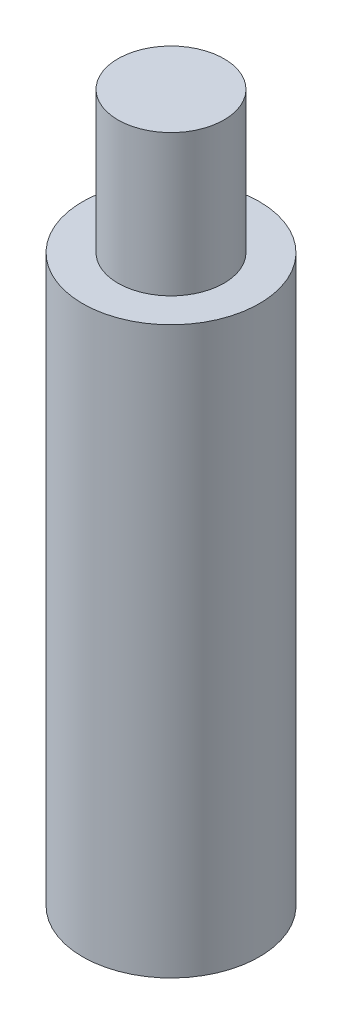
ISO-10303-21;
HEADER;
FILE_DESCRIPTION(('STEP AP214'),'2;1');
FILE_NAME('part.step','',(''),(''),'','','');
FILE_SCHEMA(('AUTOMOTIVE_DESIGN { 1 0 10303 214 1 1 1 1 }'));
ENDSEC;
DATA;
#1=APPLICATION_CONTEXT('core data for automotive mechanical design processes');
#2=APPLICATION_PROTOCOL_DEFINITION('international standard','automotive_design',2000,#1);
#3=PRODUCT_CONTEXT('',#1,'mechanical');
#4=PRODUCT('Part','Part','',(#3));
#5=PRODUCT_RELATED_PRODUCT_CATEGORY('part','',(#4));
#6=PRODUCT_DEFINITION_FORMATION('','',#4);
#7=PRODUCT_DEFINITION_CONTEXT('part definition',#1,'design');
#8=PRODUCT_DEFINITION('design','',#6,#7);
#9=PRODUCT_DEFINITION_SHAPE('','',#8);
#10=(LENGTH_UNIT() NAMED_UNIT(*) SI_UNIT(.MILLI.,.METRE.));
#11=(NAMED_UNIT(*) PLANE_ANGLE_UNIT() SI_UNIT($,.RADIAN.));
#12=(NAMED_UNIT(*) SI_UNIT($,.STERADIAN.) SOLID_ANGLE_UNIT());
#13=UNCERTAINTY_MEASURE_WITH_UNIT(LENGTH_MEASURE(1.E-05),#10,'distance_accuracy_value','');
#14=(GEOMETRIC_REPRESENTATION_CONTEXT(3) GLOBAL_UNCERTAINTY_ASSIGNED_CONTEXT((#13)) GLOBAL_UNIT_ASSIGNED_CONTEXT((#10,
#11,#12)) REPRESENTATION_CONTEXT('',''));
#15=CARTESIAN_POINT('',(0.,0.,0.));
#16=DIRECTION('',(0.,0.,1.));
#17=DIRECTION('',(1.,0.,0.));
#18=AXIS2_PLACEMENT_3D('',#15,#16,#17);
#19=CARTESIAN_POINT('',(0.,20.,0.));
#20=DIRECTION('',(0.,-1.,0.));
#21=DIRECTION('',(0.,0.,-1.));
#22=AXIS2_PLACEMENT_3D('',#19,#20,#21);
#23=CYLINDRICAL_SURFACE('',#22,1.5);
#24=CARTESIAN_POINT('',(0.,20.,0.));
#25=DIRECTION('',(0.,1.,0.));
#26=DIRECTION('',(0.,0.,1.));
#27=AXIS2_PLACEMENT_3D('',#24,#25,#26);
#28=CIRCLE('',#27,1.5);
#29=CARTESIAN_POINT('',(0.,20.,1.5));
#30=VERTEX_POINT('',#29);
#31=EDGE_CURVE('E11',#30,#30,#28,.T.);
#32=ORIENTED_EDGE('',*,*,#31,.F.);
#33=EDGE_LOOP('',(#32));
#34=FACE_BOUND('',#33,.T.);
#35=CARTESIAN_POINT('',(0.,16.,0.));
#36=DIRECTION('',(0.,1.,0.));
#37=DIRECTION('',(0.,0.,1.));
#38=AXIS2_PLACEMENT_3D('',#35,#36,#37);
#39=CIRCLE('',#38,1.5);
#40=CARTESIAN_POINT('',(0.,16.,1.5));
#41=VERTEX_POINT('',#40);
#42=EDGE_CURVE('E52',#41,#41,#39,.T.);
#43=ORIENTED_EDGE('',*,*,#42,.T.);
#44=EDGE_LOOP('',(#43));
#45=FACE_BOUND('',#44,.T.);
#46=ADVANCED_FACE('F49',(#34,#45),#23,.T.);
#47=CARTESIAN_POINT('',(0.,20.,0.));
#48=DIRECTION('',(0.,1.,0.));
#49=DIRECTION('',(0.,0.,1.));
#50=AXIS2_PLACEMENT_3D('',#47,#48,#49);
#51=PLANE('',#50);
#52=ORIENTED_EDGE('',*,*,#31,.T.);
#53=EDGE_LOOP('',(#52));
#54=FACE_BOUND('',#53,.T.);
#55=ADVANCED_FACE('F64',(#54),#51,.T.);
#56=CARTESIAN_POINT('',(0.,16.,0.));
#57=DIRECTION('',(0.,1.,0.));
#58=DIRECTION('',(0.,0.,1.));
#59=AXIS2_PLACEMENT_3D('',#56,#57,#58);
#60=PLANE('',#59);
#61=ORIENTED_EDGE('',*,*,#42,.F.);
#62=EDGE_LOOP('',(#61));
#63=FACE_BOUND('',#62,.T.);
#64=ADVANCED_FACE('F62',(#63),#60,.F.);
#65=CLOSED_SHELL('',(#46,#55,#64));
#66=MANIFOLD_SOLID_BREP('B2',#65);
#67=CARTESIAN_POINT('',(0.,16.,0.));
#68=DIRECTION('',(0.,1.,0.));
#69=DIRECTION('',(0.,0.,1.));
#70=AXIS2_PLACEMENT_3D('',#67,#68,#69);
#71=PLANE('',#70);
#72=CARTESIAN_POINT('',(0.,16.,0.));
#73=DIRECTION('',(0.,1.,0.));
#74=DIRECTION('',(0.,0.,1.));
#75=AXIS2_PLACEMENT_3D('',#72,#73,#74);
#76=CIRCLE('',#75,2.5);
#77=CARTESIAN_POINT('',(0.,16.,2.5));
#78=VERTEX_POINT('',#77);
#79=EDGE_CURVE('E48',#78,#78,#76,.T.);
#80=ORIENTED_EDGE('',*,*,#79,.T.);
#81=EDGE_LOOP('',(#80));
#82=FACE_BOUND('',#81,.T.);
#83=CARTESIAN_POINT('',(0.,16.,0.));
#84=DIRECTION('',(0.,1.,0.));
#85=DIRECTION('',(0.,0.,1.));
#86=AXIS2_PLACEMENT_3D('',#83,#84,#85);
#87=CIRCLE('',#86,1.5);
#88=CARTESIAN_POINT('',(0.,16.,1.5));
#89=VERTEX_POINT('',#88);
#90=EDGE_CURVE('E109',#89,#89,#87,.T.);
#91=ORIENTED_EDGE('',*,*,#90,.F.);
#92=EDGE_LOOP('',(#91));
#93=FACE_BOUND('',#92,.T.);
#94=ADVANCED_FACE('F96',(#82,#93),#71,.T.);
#95=CARTESIAN_POINT('',(0.,0.,0.));
#96=DIRECTION('',(0.,1.,0.));
#97=DIRECTION('',(0.,0.,1.));
#98=AXIS2_PLACEMENT_3D('',#95,#96,#97);
#99=PLANE('',#98);
#100=CARTESIAN_POINT('',(0.,0.,0.));
#101=DIRECTION('',(0.,1.,0.));
#102=DIRECTION('',(0.,0.,1.));
#103=AXIS2_PLACEMENT_3D('',#100,#101,#102);
#104=CIRCLE('',#103,2.5);
#105=CARTESIAN_POINT('',(0.,0.,2.5));
#106=VERTEX_POINT('',#105);
#107=EDGE_CURVE('E100',#106,#106,#104,.T.);
#108=ORIENTED_EDGE('',*,*,#107,.F.);
#109=EDGE_LOOP('',(#108));
#110=FACE_BOUND('',#109,.T.);
#111=CARTESIAN_POINT('',(0.,0.,0.));
#112=DIRECTION('',(0.,1.,0.));
#113=DIRECTION('',(0.,0.,1.));
#114=AXIS2_PLACEMENT_3D('',#111,#112,#113);
#115=CIRCLE('',#114,1.5);
#116=CARTESIAN_POINT('',(0.,0.,1.5));
#117=VERTEX_POINT('',#116);
#118=EDGE_CURVE('E111',#117,#117,#115,.T.);
#119=ORIENTED_EDGE('',*,*,#118,.T.);
#120=EDGE_LOOP('',(#119));
#121=FACE_BOUND('',#120,.T.);
#122=ADVANCED_FACE('F123',(#110,#121),#99,.F.);
#123=CARTESIAN_POINT('',(0.,16.,0.));
#124=DIRECTION('',(0.,-1.,0.));
#125=DIRECTION('',(0.,0.,-1.));
#126=AXIS2_PLACEMENT_3D('',#123,#124,#125);
#127=CYLINDRICAL_SURFACE('',#126,2.5);
#128=ORIENTED_EDGE('',*,*,#79,.F.);
#129=EDGE_LOOP('',(#128));
#130=FACE_BOUND('',#129,.T.);
#131=ORIENTED_EDGE('',*,*,#107,.T.);
#132=EDGE_LOOP('',(#131));
#133=FACE_BOUND('',#132,.T.);
#134=ADVANCED_FACE('F98',(#130,#133),#127,.T.);
#135=CARTESIAN_POINT('',(0.,16.,0.));
#136=DIRECTION('',(0.,-1.,0.));
#137=DIRECTION('',(0.,0.,-1.));
#138=AXIS2_PLACEMENT_3D('',#135,#136,#137);
#139=CYLINDRICAL_SURFACE('',#138,1.5);
#140=ORIENTED_EDGE('',*,*,#90,.T.);
#141=EDGE_LOOP('',(#140));
#142=FACE_BOUND('',#141,.T.);
#143=ORIENTED_EDGE('',*,*,#118,.F.);
#144=EDGE_LOOP('',(#143));
#145=FACE_BOUND('',#144,.T.);
#146=ADVANCED_FACE('F119',(#142,#145),#139,.F.);
#147=CLOSED_SHELL('',(#94,#122,#134,#146));
#148=MANIFOLD_SOLID_BREP('B6',#147);
#149=ADVANCED_BREP_SHAPE_REPRESENTATION('',(#18,#66,#148),#14);
#150=SHAPE_DEFINITION_REPRESENTATION(#9,#149);
ENDSEC;
END-ISO-10303-21;
